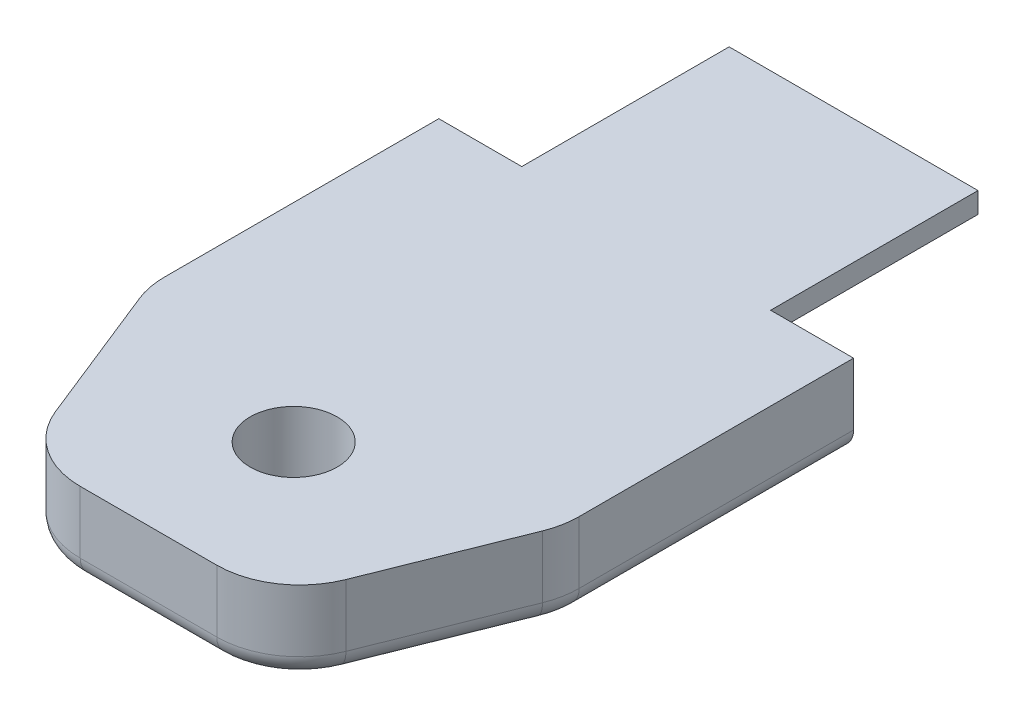
ISO-10303-21;
HEADER;
FILE_DESCRIPTION(('STEP AP214'),'2;1');
FILE_NAME('part.step','',(''),(''),'','','');
FILE_SCHEMA(('AUTOMOTIVE_DESIGN { 1 0 10303 214 1 1 1 1 }'));
ENDSEC;
DATA;
#1=APPLICATION_CONTEXT('core data for automotive mechanical design processes');
#2=APPLICATION_PROTOCOL_DEFINITION('international standard','automotive_design',2000,#1);
#3=PRODUCT_CONTEXT('',#1,'mechanical');
#4=PRODUCT('Part','Part','',(#3));
#5=PRODUCT_RELATED_PRODUCT_CATEGORY('part','',(#4));
#6=PRODUCT_DEFINITION_FORMATION('','',#4);
#7=PRODUCT_DEFINITION_CONTEXT('part definition',#1,'design');
#8=PRODUCT_DEFINITION('design','',#6,#7);
#9=PRODUCT_DEFINITION_SHAPE('','',#8);
#10=(LENGTH_UNIT() NAMED_UNIT(*) SI_UNIT(.MILLI.,.METRE.));
#11=(NAMED_UNIT(*) PLANE_ANGLE_UNIT() SI_UNIT($,.RADIAN.));
#12=(NAMED_UNIT(*) SI_UNIT($,.STERADIAN.) SOLID_ANGLE_UNIT());
#13=UNCERTAINTY_MEASURE_WITH_UNIT(LENGTH_MEASURE(1.E-05),#10,'distance_accuracy_value','');
#14=(GEOMETRIC_REPRESENTATION_CONTEXT(3) GLOBAL_UNCERTAINTY_ASSIGNED_CONTEXT((#13)) GLOBAL_UNIT_ASSIGNED_CONTEXT((#10,
#11,#12)) REPRESENTATION_CONTEXT('',''));
#15=CARTESIAN_POINT('',(0.,0.,0.));
#16=DIRECTION('',(0.,0.,1.));
#17=DIRECTION('',(1.,0.,0.));
#18=AXIS2_PLACEMENT_3D('',#15,#16,#17);
#19=CARTESIAN_POINT('',(-6.00000000000001,3.,10.));
#20=DIRECTION('',(0.707106781186548,0.707106781186547,0.));
#21=DIRECTION('',(-0.707106781186547,0.707106781186548,0.));
#22=AXIS2_PLACEMENT_3D('',#19,#20,#21);
#23=PLANE('',#22);
#24=DIRECTION('',(0.707106781186547,-0.707106781186548,0.));
#25=VECTOR('',#24,1.);
#26=CARTESIAN_POINT('',(-6.00000000000001,3.,0.));
#27=LINE('',#26,#25);
#28=CARTESIAN_POINT('',(-6.00000000000001,3.,0.));
#29=VERTEX_POINT('',#28);
#30=CARTESIAN_POINT('',(-3.00000000000001,0.,0.));
#31=VERTEX_POINT('',#30);
#32=EDGE_CURVE('E203',#29,#31,#27,.T.);
#33=ORIENTED_EDGE('',*,*,#32,.T.);
#34=DIRECTION('',(0.,0.,-1.));
#35=VECTOR('',#34,1.);
#36=CARTESIAN_POINT('',(-3.00000000000001,0.,10.));
#37=LINE('',#36,#35);
#38=CARTESIAN_POINT('',(-3.00000000000001,0.,10.));
#39=VERTEX_POINT('',#38);
#40=EDGE_CURVE('E403',#39,#31,#37,.T.);
#41=ORIENTED_EDGE('',*,*,#40,.F.);
#42=DIRECTION('',(0.707106781186547,-0.707106781186548,0.));
#43=VECTOR('',#42,1.);
#44=CARTESIAN_POINT('',(-6.00000000000001,3.,10.));
#45=LINE('',#44,#43);
#46=CARTESIAN_POINT('',(-6.00000000000001,3.,10.));
#47=VERTEX_POINT('',#46);
#48=EDGE_CURVE('E409',#47,#39,#45,.T.);
#49=ORIENTED_EDGE('',*,*,#48,.F.);
#50=DIRECTION('',(0.,0.,-1.));
#51=VECTOR('',#50,1.);
#52=CARTESIAN_POINT('',(-6.00000000000001,3.,10.));
#53=LINE('',#52,#51);
#54=EDGE_CURVE('E454',#47,#29,#53,.T.);
#55=ORIENTED_EDGE('',*,*,#54,.T.);
#56=EDGE_LOOP('',(#33,#41,#49,#55));
#57=FACE_BOUND('',#56,.T.);
#58=ADVANCED_FACE('F36',(#57),#23,.F.);
#59=CARTESIAN_POINT('',(-3.00000000000001,0.,10.));
#60=DIRECTION('',(0.,1.,0.));
#61=DIRECTION('',(0.,0.,1.));
#62=AXIS2_PLACEMENT_3D('',#59,#60,#61);
#63=PLANE('',#62);
#64=CARTESIAN_POINT('',(0.,0.,27.));
#65=DIRECTION('',(0.,-1.,0.));
#66=DIRECTION('',(0.,0.,-1.));
#67=AXIS2_PLACEMENT_3D('',#64,#65,#66);
#68=CIRCLE('',#67,2.1);
#69=CARTESIAN_POINT('',(0.,0.,24.9));
#70=VERTEX_POINT('',#69);
#71=EDGE_CURVE('E238',#70,#70,#68,.T.);
#72=ORIENTED_EDGE('',*,*,#71,.F.);
#73=EDGE_LOOP('',(#72));
#74=FACE_BOUND('',#73,.T.);
#75=DIRECTION('',(1.,0.,0.));
#76=VECTOR('',#75,1.);
#77=CARTESIAN_POINT('',(-10.,0.,10.));
#78=LINE('',#77,#76);
#79=CARTESIAN_POINT('',(3.,0.,10.));
#80=VERTEX_POINT('',#79);
#81=CARTESIAN_POINT('',(9.,0.,10.));
#82=VERTEX_POINT('',#81);
#83=EDGE_CURVE('E233',#80,#82,#78,.T.);
#84=ORIENTED_EDGE('',*,*,#83,.T.);
#85=DIRECTION('',(0.,0.,-1.));
#86=VECTOR('',#85,1.);
#87=CARTESIAN_POINT('',(9.,0.,10.));
#88=LINE('',#87,#86);
#89=CARTESIAN_POINT('',(9.,0.,23.2296703857309));
#90=VERTEX_POINT('',#89);
#91=EDGE_CURVE('E265',#82,#90,#88,.F.);
#92=ORIENTED_EDGE('',*,*,#91,.T.);
#93=CARTESIAN_POINT('',(6.,0.,23.2296703857309));
#94=DIRECTION('',(0.,1.,0.));
#95=DIRECTION('',(0.,0.,1.));
#96=AXIS2_PLACEMENT_3D('',#93,#94,#95);
#97=CIRCLE('',#96,3.);
#98=CARTESIAN_POINT('',(8.78543007265578,0.,24.3438424147932));
#99=VERTEX_POINT('',#98);
#100=EDGE_CURVE('E263',#90,#99,#97,.F.);
#101=ORIENTED_EDGE('',*,*,#100,.T.);
#102=DIRECTION('',(0.371390676354101,0.,-0.92847669088526));
#103=VECTOR('',#102,1.);
#104=CARTESIAN_POINT('',(6.07729822694816,0.,31.1141720290623));
#105=LINE('',#104,#103);
#106=CARTESIAN_POINT('',(6.07729822694816,0.,31.1141720290623));
#107=VERTEX_POINT('',#106);
#108=EDGE_CURVE('E261',#99,#107,#105,.F.);
#109=ORIENTED_EDGE('',*,*,#108,.T.);
#110=CARTESIAN_POINT('',(3.29186815429238,0.,30.));
#111=DIRECTION('',(0.,1.,0.));
#112=DIRECTION('',(0.,0.,1.));
#113=AXIS2_PLACEMENT_3D('',#110,#111,#112);
#114=CIRCLE('',#113,3.);
#115=CARTESIAN_POINT('',(3.29186815429238,0.,33.));
#116=VERTEX_POINT('',#115);
#117=EDGE_CURVE('E259',#107,#116,#114,.F.);
#118=ORIENTED_EDGE('',*,*,#117,.T.);
#119=DIRECTION('',(1.,0.,0.));
#120=VECTOR('',#119,1.);
#121=CARTESIAN_POINT('',(-3.00000000000001,0.,33.));
#122=LINE('',#121,#120);
#123=CARTESIAN_POINT('',(-3.29186815429238,0.,33.));
#124=VERTEX_POINT('',#123);
#125=EDGE_CURVE('E257',#116,#124,#122,.F.);
#126=ORIENTED_EDGE('',*,*,#125,.T.);
#127=CARTESIAN_POINT('',(-3.29186815429238,0.,30.));
#128=DIRECTION('',(0.,1.,0.));
#129=DIRECTION('',(0.,0.,1.));
#130=AXIS2_PLACEMENT_3D('',#127,#128,#129);
#131=CIRCLE('',#130,3.);
#132=CARTESIAN_POINT('',(-6.07729822694816,0.,31.1141720290623));
#133=VERTEX_POINT('',#132);
#134=EDGE_CURVE('E255',#124,#133,#131,.F.);
#135=ORIENTED_EDGE('',*,*,#134,.T.);
#136=DIRECTION('',(0.371390676354101,0.,0.92847669088526));
#137=VECTOR('',#136,1.);
#138=CARTESIAN_POINT('',(-8.78543007265578,0.,24.3438424147932));
#139=LINE('',#138,#137);
#140=CARTESIAN_POINT('',(-8.78543007265578,0.,24.3438424147932));
#141=VERTEX_POINT('',#140);
#142=EDGE_CURVE('E253',#133,#141,#139,.F.);
#143=ORIENTED_EDGE('',*,*,#142,.T.);
#144=CARTESIAN_POINT('',(-6.,0.,23.2296703857309));
#145=DIRECTION('',(0.,1.,0.));
#146=DIRECTION('',(0.,0.,1.));
#147=AXIS2_PLACEMENT_3D('',#144,#145,#146);
#148=CIRCLE('',#147,3.);
#149=CARTESIAN_POINT('',(-9.,0.,23.2296703857309));
#150=VERTEX_POINT('',#149);
#151=EDGE_CURVE('E251',#141,#150,#148,.F.);
#152=ORIENTED_EDGE('',*,*,#151,.T.);
#153=DIRECTION('',(0.,0.,-1.));
#154=VECTOR('',#153,1.);
#155=CARTESIAN_POINT('',(-9.,0.,10.));
#156=LINE('',#155,#154);
#157=CARTESIAN_POINT('',(-9.,0.,10.));
#158=VERTEX_POINT('',#157);
#159=EDGE_CURVE('E249',#150,#158,#156,.T.);
#160=ORIENTED_EDGE('',*,*,#159,.T.);
#161=EDGE_CURVE('E192',#158,#39,#78,.T.);
#162=ORIENTED_EDGE('',*,*,#161,.T.);
#163=ORIENTED_EDGE('',*,*,#40,.T.);
#164=DIRECTION('',(1.,0.,0.));
#165=VECTOR('',#164,1.);
#166=CARTESIAN_POINT('',(-3.00000000000001,0.,0.));
#167=LINE('',#166,#165);
#168=CARTESIAN_POINT('',(3.,0.,0.));
#169=VERTEX_POINT('',#168);
#170=EDGE_CURVE('E465',#31,#169,#167,.T.);
#171=ORIENTED_EDGE('',*,*,#170,.T.);
#172=DIRECTION('',(0.,0.,-1.));
#173=VECTOR('',#172,1.);
#174=CARTESIAN_POINT('',(3.,0.,10.));
#175=LINE('',#174,#173);
#176=EDGE_CURVE('E325',#80,#169,#175,.T.);
#177=ORIENTED_EDGE('',*,*,#176,.F.);
#178=EDGE_LOOP('',(#84,#92,#101,#109,#118,#126,#135,#143,#152,#160,#162,#163,#171,#177));
#179=FACE_BOUND('',#178,.T.);
#180=ADVANCED_FACE('F316',(#74,#179),#63,.F.);
#181=CARTESIAN_POINT('',(3.,0.,10.));
#182=DIRECTION('',(-0.707106781186548,0.707106781186547,0.));
#183=DIRECTION('',(-0.707106781186547,-0.707106781186548,0.));
#184=AXIS2_PLACEMENT_3D('',#181,#182,#183);
#185=PLANE('',#184);
#186=DIRECTION('',(0.707106781186547,0.707106781186548,0.));
#187=VECTOR('',#186,1.);
#188=CARTESIAN_POINT('',(3.,0.,0.));
#189=LINE('',#188,#187);
#190=CARTESIAN_POINT('',(6.,3.,0.));
#191=VERTEX_POINT('',#190);
#192=EDGE_CURVE('E437',#169,#191,#189,.T.);
#193=ORIENTED_EDGE('',*,*,#192,.T.);
#194=DIRECTION('',(0.,0.,-1.));
#195=VECTOR('',#194,1.);
#196=CARTESIAN_POINT('',(6.,3.,10.));
#197=LINE('',#196,#195);
#198=CARTESIAN_POINT('',(6.,3.,10.));
#199=VERTEX_POINT('',#198);
#200=EDGE_CURVE('E429',#199,#191,#197,.T.);
#201=ORIENTED_EDGE('',*,*,#200,.F.);
#202=DIRECTION('',(0.707106781186547,0.707106781186548,0.));
#203=VECTOR('',#202,1.);
#204=CARTESIAN_POINT('',(3.,0.,10.));
#205=LINE('',#204,#203);
#206=EDGE_CURVE('E412',#80,#199,#205,.T.);
#207=ORIENTED_EDGE('',*,*,#206,.F.);
#208=ORIENTED_EDGE('',*,*,#176,.T.);
#209=EDGE_LOOP('',(#193,#201,#207,#208));
#210=FACE_BOUND('',#209,.T.);
#211=ADVANCED_FACE('F319',(#210),#185,.F.);
#212=CARTESIAN_POINT('',(6.,3.,10.));
#213=DIRECTION('',(-1.,0.,0.));
#214=DIRECTION('',(0.,-1.,0.));
#215=AXIS2_PLACEMENT_3D('',#212,#213,#214);
#216=PLANE('',#215);
#217=DIRECTION('',(0.,1.,0.));
#218=VECTOR('',#217,1.);
#219=CARTESIAN_POINT('',(6.,3.,0.));
#220=LINE('',#219,#218);
#221=CARTESIAN_POINT('',(6.,4.,0.));
#222=VERTEX_POINT('',#221);
#223=EDGE_CURVE('E442',#191,#222,#220,.T.);
#224=ORIENTED_EDGE('',*,*,#223,.T.);
#225=DIRECTION('',(0.,0.,-1.));
#226=VECTOR('',#225,1.);
#227=CARTESIAN_POINT('',(6.,4.,10.));
#228=LINE('',#227,#226);
#229=CARTESIAN_POINT('',(6.,4.,10.));
#230=VERTEX_POINT('',#229);
#231=EDGE_CURVE('E427',#230,#222,#228,.T.);
#232=ORIENTED_EDGE('',*,*,#231,.F.);
#233=DIRECTION('',(0.,1.,0.));
#234=VECTOR('',#233,1.);
#235=CARTESIAN_POINT('',(6.,3.,10.));
#236=LINE('',#235,#234);
#237=EDGE_CURVE('E210',#199,#230,#236,.T.);
#238=ORIENTED_EDGE('',*,*,#237,.F.);
#239=ORIENTED_EDGE('',*,*,#200,.T.);
#240=EDGE_LOOP('',(#224,#232,#238,#239));
#241=FACE_BOUND('',#240,.T.);
#242=ADVANCED_FACE('F441',(#241),#216,.F.);
#243=CARTESIAN_POINT('',(6.,4.,10.));
#244=DIRECTION('',(0.,-1.,0.));
#245=DIRECTION('',(1.,0.,0.));
#246=AXIS2_PLACEMENT_3D('',#243,#244,#245);
#247=PLANE('',#246);
#248=CARTESIAN_POINT('',(0.,4.,27.));
#249=DIRECTION('',(0.,-1.,0.));
#250=DIRECTION('',(1.,0.,0.));
#251=AXIS2_PLACEMENT_3D('',#248,#249,#250);
#252=CIRCLE('',#251,2.1);
#253=CARTESIAN_POINT('',(2.1,4.,27.));
#254=VERTEX_POINT('',#253);
#255=EDGE_CURVE('E234',#254,#254,#252,.T.);
#256=ORIENTED_EDGE('',*,*,#255,.T.);
#257=EDGE_LOOP('',(#256));
#258=FACE_BOUND('',#257,.T.);
#259=DIRECTION('',(0.,0.,-1.));
#260=VECTOR('',#259,1.);
#261=CARTESIAN_POINT('',(-10.,4.,34.));
#262=LINE('',#261,#260);
#263=CARTESIAN_POINT('',(-10.,4.,23.2296703857309));
#264=VERTEX_POINT('',#263);
#265=CARTESIAN_POINT('',(-10.,4.,10.));
#266=VERTEX_POINT('',#265);
#267=EDGE_CURVE('E204',#264,#266,#262,.T.);
#268=ORIENTED_EDGE('',*,*,#267,.F.);
#269=CARTESIAN_POINT('',(-6.,4.,23.2296703857309));
#270=DIRECTION('',(0.,-1.,0.));
#271=DIRECTION('',(1.,0.,0.));
#272=AXIS2_PLACEMENT_3D('',#269,#270,#271);
#273=CIRCLE('',#272,4.);
#274=CARTESIAN_POINT('',(-9.71390676354104,4.,24.7152330911473));
#275=VERTEX_POINT('',#274);
#276=EDGE_CURVE('E370',#264,#275,#273,.F.);
#277=ORIENTED_EDGE('',*,*,#276,.T.);
#278=DIRECTION('',(-0.371390676354101,0.,-0.92847669088526));
#279=VECTOR('',#278,1.);
#280=CARTESIAN_POINT('',(-5.99999999999999,4.,34.));
#281=LINE('',#280,#279);
#282=CARTESIAN_POINT('',(-7.00577491783343,4.,31.4855627054164));
#283=VERTEX_POINT('',#282);
#284=EDGE_CURVE('E396',#275,#283,#281,.F.);
#285=ORIENTED_EDGE('',*,*,#284,.T.);
#286=CARTESIAN_POINT('',(-3.29186815429238,4.,30.));
#287=DIRECTION('',(0.,-1.,0.));
#288=DIRECTION('',(1.,0.,0.));
#289=AXIS2_PLACEMENT_3D('',#286,#287,#288);
#290=CIRCLE('',#289,4.);
#291=CARTESIAN_POINT('',(-3.29186815429238,4.,34.));
#292=VERTEX_POINT('',#291);
#293=EDGE_CURVE('E369',#283,#292,#290,.F.);
#294=ORIENTED_EDGE('',*,*,#293,.T.);
#295=DIRECTION('',(-1.,0.,0.));
#296=VECTOR('',#295,1.);
#297=CARTESIAN_POINT('',(-10.,4.,34.));
#298=LINE('',#297,#296);
#299=CARTESIAN_POINT('',(3.29186815429238,4.,34.));
#300=VERTEX_POINT('',#299);
#301=EDGE_CURVE('E211',#300,#292,#298,.T.);
#302=ORIENTED_EDGE('',*,*,#301,.F.);
#303=CARTESIAN_POINT('',(3.29186815429238,4.,30.));
#304=DIRECTION('',(0.,-1.,0.));
#305=DIRECTION('',(1.,0.,0.));
#306=AXIS2_PLACEMENT_3D('',#303,#304,#305);
#307=CIRCLE('',#306,4.);
#308=CARTESIAN_POINT('',(7.00577491783343,4.,31.4855627054164));
#309=VERTEX_POINT('',#308);
#310=EDGE_CURVE('E395',#300,#309,#307,.F.);
#311=ORIENTED_EDGE('',*,*,#310,.T.);
#312=DIRECTION('',(-0.371390676354101,0.,0.92847669088526));
#313=VECTOR('',#312,1.);
#314=CARTESIAN_POINT('',(5.99999999999999,4.,34.));
#315=LINE('',#314,#313);
#316=CARTESIAN_POINT('',(9.71390676354104,4.,24.7152330911473));
#317=VERTEX_POINT('',#316);
#318=EDGE_CURVE('E390',#309,#317,#315,.F.);
#319=ORIENTED_EDGE('',*,*,#318,.T.);
#320=CARTESIAN_POINT('',(6.,4.,23.2296703857309));
#321=DIRECTION('',(0.,-1.,0.));
#322=DIRECTION('',(1.,0.,0.));
#323=AXIS2_PLACEMENT_3D('',#320,#321,#322);
#324=CIRCLE('',#323,4.);
#325=CARTESIAN_POINT('',(10.,4.,23.2296703857309));
#326=VERTEX_POINT('',#325);
#327=EDGE_CURVE('E202',#317,#326,#324,.F.);
#328=ORIENTED_EDGE('',*,*,#327,.T.);
#329=DIRECTION('',(0.,0.,-1.));
#330=VECTOR('',#329,1.);
#331=CARTESIAN_POINT('',(10.,4.,34.));
#332=LINE('',#331,#330);
#333=CARTESIAN_POINT('',(10.,4.,10.));
#334=VERTEX_POINT('',#333);
#335=EDGE_CURVE('E185',#326,#334,#332,.T.);
#336=ORIENTED_EDGE('',*,*,#335,.T.);
#337=DIRECTION('',(-1.,0.,0.));
#338=VECTOR('',#337,1.);
#339=CARTESIAN_POINT('',(-10.,4.,10.));
#340=LINE('',#339,#338);
#341=EDGE_CURVE('E199',#334,#230,#340,.T.);
#342=ORIENTED_EDGE('',*,*,#341,.T.);
#343=ORIENTED_EDGE('',*,*,#231,.T.);
#344=DIRECTION('',(-1.,0.,0.));
#345=VECTOR('',#344,1.);
#346=CARTESIAN_POINT('',(6.,4.,0.));
#347=LINE('',#346,#345);
#348=CARTESIAN_POINT('',(-6.,4.,0.));
#349=VERTEX_POINT('',#348);
#350=EDGE_CURVE('E444',#222,#349,#347,.T.);
#351=ORIENTED_EDGE('',*,*,#350,.T.);
#352=DIRECTION('',(0.,0.,-1.));
#353=VECTOR('',#352,1.);
#354=CARTESIAN_POINT('',(-6.,4.,10.));
#355=LINE('',#354,#353);
#356=CARTESIAN_POINT('',(-6.,4.,10.));
#357=VERTEX_POINT('',#356);
#358=EDGE_CURVE('E229',#357,#349,#355,.T.);
#359=ORIENTED_EDGE('',*,*,#358,.F.);
#360=EDGE_CURVE('E191',#357,#266,#340,.T.);
#361=ORIENTED_EDGE('',*,*,#360,.T.);
#362=EDGE_LOOP('',(#268,#277,#285,#294,#302,#311,#319,#328,#336,#342,#343,#351,#359,#361));
#363=FACE_BOUND('',#362,.T.);
#364=ADVANCED_FACE('F197',(#258,#363),#247,.F.);
#365=CARTESIAN_POINT('',(-6.,4.,10.));
#366=DIRECTION('',(1.,0.,0.));
#367=DIRECTION('',(0.,1.,0.));
#368=AXIS2_PLACEMENT_3D('',#365,#366,#367);
#369=PLANE('',#368);
#370=DIRECTION('',(0.,-1.,0.));
#371=VECTOR('',#370,1.);
#372=CARTESIAN_POINT('',(-6.,4.,0.));
#373=LINE('',#372,#371);
#374=EDGE_CURVE('E413',#349,#29,#373,.T.);
#375=ORIENTED_EDGE('',*,*,#374,.T.);
#376=ORIENTED_EDGE('',*,*,#54,.F.);
#377=DIRECTION('',(0.,-1.,0.));
#378=VECTOR('',#377,1.);
#379=CARTESIAN_POINT('',(-6.,4.,10.));
#380=LINE('',#379,#378);
#381=EDGE_CURVE('E424',#357,#47,#380,.T.);
#382=ORIENTED_EDGE('',*,*,#381,.F.);
#383=ORIENTED_EDGE('',*,*,#358,.T.);
#384=EDGE_LOOP('',(#375,#376,#382,#383));
#385=FACE_BOUND('',#384,.T.);
#386=ADVANCED_FACE('F461',(#385),#369,.F.);
#387=CARTESIAN_POINT('',(0.,0.,0.));
#388=DIRECTION('',(0.,0.,1.));
#389=DIRECTION('',(1.,0.,0.));
#390=AXIS2_PLACEMENT_3D('',#387,#388,#389);
#391=PLANE('',#390);
#392=ORIENTED_EDGE('',*,*,#32,.F.);
#393=ORIENTED_EDGE('',*,*,#374,.F.);
#394=ORIENTED_EDGE('',*,*,#350,.F.);
#395=ORIENTED_EDGE('',*,*,#223,.F.);
#396=ORIENTED_EDGE('',*,*,#192,.F.);
#397=ORIENTED_EDGE('',*,*,#170,.F.);
#398=EDGE_LOOP('',(#392,#393,#394,#395,#396,#397));
#399=FACE_BOUND('',#398,.T.);
#400=ADVANCED_FACE('F448',(#399),#391,.F.);
#401=CARTESIAN_POINT('',(0.,0.,10.));
#402=DIRECTION('',(0.,0.,-1.));
#403=DIRECTION('',(-1.,0.,0.));
#404=AXIS2_PLACEMENT_3D('',#401,#402,#403);
#405=PLANE('',#404);
#406=DIRECTION('',(0.,1.,0.));
#407=VECTOR('',#406,1.);
#408=CARTESIAN_POINT('',(10.,0.,10.));
#409=LINE('',#408,#407);
#410=CARTESIAN_POINT('',(10.,1.,10.));
#411=VERTEX_POINT('',#410);
#412=EDGE_CURVE('E181',#411,#334,#409,.T.);
#413=ORIENTED_EDGE('',*,*,#412,.F.);
#414=CARTESIAN_POINT('',(9.,1.,10.));
#415=DIRECTION('',(0.,0.,-1.));
#416=DIRECTION('',(-1.,0.,0.));
#417=AXIS2_PLACEMENT_3D('',#414,#415,#416);
#418=CIRCLE('',#417,1.);
#419=EDGE_CURVE('E247',#411,#82,#418,.T.);
#420=ORIENTED_EDGE('',*,*,#419,.T.);
#421=ORIENTED_EDGE('',*,*,#83,.F.);
#422=ORIENTED_EDGE('',*,*,#206,.T.);
#423=ORIENTED_EDGE('',*,*,#237,.T.);
#424=ORIENTED_EDGE('',*,*,#341,.F.);
#425=EDGE_LOOP('',(#413,#420,#421,#422,#423,#424));
#426=FACE_BOUND('',#425,.T.);
#427=ADVANCED_FACE('F207',(#426),#405,.T.);
#428=CARTESIAN_POINT('',(-10.,0.,34.));
#429=DIRECTION('',(1.,0.,0.));
#430=DIRECTION('',(0.,0.,-1.));
#431=AXIS2_PLACEMENT_3D('',#428,#429,#430);
#432=PLANE('',#431);
#433=DIRECTION('',(0.,-1.,0.));
#434=VECTOR('',#433,1.);
#435=CARTESIAN_POINT('',(-10.,0.,10.));
#436=LINE('',#435,#434);
#437=CARTESIAN_POINT('',(-10.,1.,10.));
#438=VERTEX_POINT('',#437);
#439=EDGE_CURVE('E224',#266,#438,#436,.T.);
#440=ORIENTED_EDGE('',*,*,#439,.T.);
#441=DIRECTION('',(0.,0.,-1.));
#442=VECTOR('',#441,1.);
#443=CARTESIAN_POINT('',(-10.,1.,34.));
#444=LINE('',#443,#442);
#445=CARTESIAN_POINT('',(-10.,1.,23.2296703857309));
#446=VERTEX_POINT('',#445);
#447=EDGE_CURVE('E11',#438,#446,#444,.F.);
#448=ORIENTED_EDGE('',*,*,#447,.T.);
#449=DIRECTION('',(0.,-1.,0.));
#450=VECTOR('',#449,1.);
#451=CARTESIAN_POINT('',(-10.,4.,23.2296703857309));
#452=LINE('',#451,#450);
#453=EDGE_CURVE('E225',#446,#264,#452,.F.);
#454=ORIENTED_EDGE('',*,*,#453,.T.);
#455=ORIENTED_EDGE('',*,*,#267,.T.);
#456=EDGE_LOOP('',(#440,#448,#454,#455));
#457=FACE_BOUND('',#456,.T.);
#458=ADVANCED_FACE('F223',(#457),#432,.F.);
#459=CARTESIAN_POINT('',(10.,0.,34.));
#460=DIRECTION('',(-1.,0.,0.));
#461=DIRECTION('',(0.,0.,1.));
#462=AXIS2_PLACEMENT_3D('',#459,#460,#461);
#463=PLANE('',#462);
#464=DIRECTION('',(0.,1.,0.));
#465=VECTOR('',#464,1.);
#466=CARTESIAN_POINT('',(10.,0.,23.2296703857309));
#467=LINE('',#466,#465);
#468=CARTESIAN_POINT('',(10.,1.,23.2296703857309));
#469=VERTEX_POINT('',#468);
#470=EDGE_CURVE('E380',#326,#469,#467,.F.);
#471=ORIENTED_EDGE('',*,*,#470,.T.);
#472=DIRECTION('',(0.,0.,-1.));
#473=VECTOR('',#472,1.);
#474=CARTESIAN_POINT('',(10.,1.,34.));
#475=LINE('',#474,#473);
#476=EDGE_CURVE('E188',#469,#411,#475,.T.);
#477=ORIENTED_EDGE('',*,*,#476,.T.);
#478=ORIENTED_EDGE('',*,*,#412,.T.);
#479=ORIENTED_EDGE('',*,*,#335,.F.);
#480=EDGE_LOOP('',(#471,#477,#478,#479));
#481=FACE_BOUND('',#480,.T.);
#482=ADVANCED_FACE('F184',(#481),#463,.F.);
#483=CARTESIAN_POINT('',(0.,0.,34.));
#484=DIRECTION('',(0.,0.,-1.));
#485=DIRECTION('',(-1.,0.,0.));
#486=AXIS2_PLACEMENT_3D('',#483,#484,#485);
#487=PLANE('',#486);
#488=DIRECTION('',(0.,1.,0.));
#489=VECTOR('',#488,1.);
#490=CARTESIAN_POINT('',(-3.29186815429238,0.,34.));
#491=LINE('',#490,#489);
#492=CARTESIAN_POINT('',(-3.29186815429238,1.,34.));
#493=VERTEX_POINT('',#492);
#494=EDGE_CURVE('E378',#292,#493,#491,.F.);
#495=ORIENTED_EDGE('',*,*,#494,.T.);
#496=DIRECTION('',(1.,0.,0.));
#497=VECTOR('',#496,1.);
#498=CARTESIAN_POINT('',(0.,1.,34.));
#499=LINE('',#498,#497);
#500=CARTESIAN_POINT('',(3.29186815429238,1.,34.));
#501=VERTEX_POINT('',#500);
#502=EDGE_CURVE('E273',#493,#501,#499,.T.);
#503=ORIENTED_EDGE('',*,*,#502,.T.);
#504=DIRECTION('',(0.,-1.,0.));
#505=VECTOR('',#504,1.);
#506=CARTESIAN_POINT('',(3.29186815429238,4.,34.));
#507=LINE('',#506,#505);
#508=EDGE_CURVE('E372',#501,#300,#507,.F.);
#509=ORIENTED_EDGE('',*,*,#508,.T.);
#510=ORIENTED_EDGE('',*,*,#301,.T.);
#511=EDGE_LOOP('',(#495,#503,#509,#510));
#512=FACE_BOUND('',#511,.T.);
#513=ADVANCED_FACE('F472',(#512),#487,.F.);
#514=ORIENTED_EDGE('',*,*,#161,.F.);
#515=CARTESIAN_POINT('',(-9.,1.,10.));
#516=DIRECTION('',(0.,0.,-1.));
#517=DIRECTION('',(-1.,0.,0.));
#518=AXIS2_PLACEMENT_3D('',#515,#516,#517);
#519=CIRCLE('',#518,1.);
#520=EDGE_CURVE('E45',#158,#438,#519,.T.);
#521=ORIENTED_EDGE('',*,*,#520,.T.);
#522=ORIENTED_EDGE('',*,*,#439,.F.);
#523=ORIENTED_EDGE('',*,*,#360,.F.);
#524=ORIENTED_EDGE('',*,*,#381,.T.);
#525=ORIENTED_EDGE('',*,*,#48,.T.);
#526=EDGE_LOOP('',(#514,#521,#522,#523,#524,#525));
#527=FACE_BOUND('',#526,.T.);
#528=ADVANCED_FACE('F232',(#527),#405,.T.);
#529=CARTESIAN_POINT('',(0.,4.00005,27.));
#530=DIRECTION('',(0.,-1.,0.));
#531=DIRECTION('',(0.,0.,-1.));
#532=AXIS2_PLACEMENT_3D('',#529,#530,#531);
#533=CYLINDRICAL_SURFACE('',#532,2.1);
#534=ORIENTED_EDGE('',*,*,#71,.T.);
#535=EDGE_LOOP('',(#534));
#536=FACE_BOUND('',#535,.T.);
#537=ORIENTED_EDGE('',*,*,#255,.F.);
#538=EDGE_LOOP('',(#537));
#539=FACE_BOUND('',#538,.T.);
#540=ADVANCED_FACE('F313',(#536,#539),#533,.F.);
#541=CARTESIAN_POINT('',(5.99999999999999,0.,34.));
#542=DIRECTION('',(-0.92847669088526,0.,-0.371390676354101));
#543=DIRECTION('',(0.,1.,0.));
#544=AXIS2_PLACEMENT_3D('',#541,#542,#543);
#545=PLANE('',#544);
#546=DIRECTION('',(0.,1.,0.));
#547=VECTOR('',#546,1.);
#548=CARTESIAN_POINT('',(7.00577491783343,0.,31.4855627054164));
#549=LINE('',#548,#547);
#550=CARTESIAN_POINT('',(7.00577491783343,1.,31.4855627054164));
#551=VERTEX_POINT('',#550);
#552=EDGE_CURVE('E382',#309,#551,#549,.F.);
#553=ORIENTED_EDGE('',*,*,#552,.T.);
#554=DIRECTION('',(-0.371390676354101,0.,0.92847669088526));
#555=VECTOR('',#554,1.);
#556=CARTESIAN_POINT('',(9.71390676354104,1.,24.7152330911473));
#557=LINE('',#556,#555);
#558=CARTESIAN_POINT('',(9.71390676354104,1.,24.7152330911473));
#559=VERTEX_POINT('',#558);
#560=EDGE_CURVE('E269',#551,#559,#557,.F.);
#561=ORIENTED_EDGE('',*,*,#560,.T.);
#562=DIRECTION('',(0.,-1.,0.));
#563=VECTOR('',#562,1.);
#564=CARTESIAN_POINT('',(9.71390676354104,4.,24.7152330911473));
#565=LINE('',#564,#563);
#566=EDGE_CURVE('E385',#559,#317,#565,.F.);
#567=ORIENTED_EDGE('',*,*,#566,.T.);
#568=ORIENTED_EDGE('',*,*,#318,.F.);
#569=EDGE_LOOP('',(#553,#561,#567,#568));
#570=FACE_BOUND('',#569,.T.);
#571=ADVANCED_FACE('F389',(#570),#545,.F.);
#572=CARTESIAN_POINT('',(-5.99999999999999,0.,34.));
#573=DIRECTION('',(0.92847669088526,0.,-0.371390676354101));
#574=DIRECTION('',(0.,-1.,0.));
#575=AXIS2_PLACEMENT_3D('',#572,#573,#574);
#576=PLANE('',#575);
#577=DIRECTION('',(0.,1.,0.));
#578=VECTOR('',#577,1.);
#579=CARTESIAN_POINT('',(-9.71390676354104,0.,24.7152330911473));
#580=LINE('',#579,#578);
#581=CARTESIAN_POINT('',(-9.71390676354104,1.,24.7152330911473));
#582=VERTEX_POINT('',#581);
#583=EDGE_CURVE('E363',#275,#582,#580,.F.);
#584=ORIENTED_EDGE('',*,*,#583,.T.);
#585=DIRECTION('',(-0.371390676354101,0.,-0.92847669088526));
#586=VECTOR('',#585,1.);
#587=CARTESIAN_POINT('',(-7.00577491783343,1.,31.4855627054164));
#588=LINE('',#587,#586);
#589=CARTESIAN_POINT('',(-7.00577491783343,1.,31.4855627054164));
#590=VERTEX_POINT('',#589);
#591=EDGE_CURVE('E277',#582,#590,#588,.F.);
#592=ORIENTED_EDGE('',*,*,#591,.T.);
#593=DIRECTION('',(0.,-1.,0.));
#594=VECTOR('',#593,1.);
#595=CARTESIAN_POINT('',(-7.00577491783343,4.,31.4855627054164));
#596=LINE('',#595,#594);
#597=EDGE_CURVE('E360',#590,#283,#596,.F.);
#598=ORIENTED_EDGE('',*,*,#597,.T.);
#599=ORIENTED_EDGE('',*,*,#284,.F.);
#600=EDGE_LOOP('',(#584,#592,#598,#599));
#601=FACE_BOUND('',#600,.T.);
#602=ADVANCED_FACE('F358',(#601),#576,.F.);
#603=CARTESIAN_POINT('',(-6.,0.,23.2296703857309));
#604=DIRECTION('',(0.,1.,0.));
#605=DIRECTION('',(0.,0.,1.));
#606=AXIS2_PLACEMENT_3D('',#603,#604,#605);
#607=CYLINDRICAL_SURFACE('',#606,4.);
#608=ORIENTED_EDGE('',*,*,#453,.F.);
#609=CARTESIAN_POINT('',(-6.,1.,23.2296703857309));
#610=DIRECTION('',(0.,1.,0.));
#611=DIRECTION('',(0.,0.,1.));
#612=AXIS2_PLACEMENT_3D('',#609,#610,#611);
#613=CIRCLE('',#612,4.);
#614=EDGE_CURVE('E279',#446,#582,#613,.T.);
#615=ORIENTED_EDGE('',*,*,#614,.T.);
#616=ORIENTED_EDGE('',*,*,#583,.F.);
#617=ORIENTED_EDGE('',*,*,#276,.F.);
#618=EDGE_LOOP('',(#608,#615,#616,#617));
#619=FACE_BOUND('',#618,.T.);
#620=ADVANCED_FACE('F470',(#619),#607,.T.);
#621=CARTESIAN_POINT('',(-3.29186815429238,0.,30.));
#622=DIRECTION('',(0.,-1.,0.));
#623=DIRECTION('',(0.,0.,-1.));
#624=AXIS2_PLACEMENT_3D('',#621,#622,#623);
#625=CYLINDRICAL_SURFACE('',#624,4.);
#626=ORIENTED_EDGE('',*,*,#597,.F.);
#627=CARTESIAN_POINT('',(-3.29186815429238,1.,30.));
#628=DIRECTION('',(0.,1.,0.));
#629=DIRECTION('',(0.,0.,1.));
#630=AXIS2_PLACEMENT_3D('',#627,#628,#629);
#631=CIRCLE('',#630,4.);
#632=EDGE_CURVE('E275',#590,#493,#631,.T.);
#633=ORIENTED_EDGE('',*,*,#632,.T.);
#634=ORIENTED_EDGE('',*,*,#494,.F.);
#635=ORIENTED_EDGE('',*,*,#293,.F.);
#636=EDGE_LOOP('',(#626,#633,#634,#635));
#637=FACE_BOUND('',#636,.T.);
#638=ADVANCED_FACE('F366',(#637),#625,.T.);
#639=CARTESIAN_POINT('',(6.,0.,23.2296703857309));
#640=DIRECTION('',(0.,-1.,0.));
#641=DIRECTION('',(0.,0.,-1.));
#642=AXIS2_PLACEMENT_3D('',#639,#640,#641);
#643=CYLINDRICAL_SURFACE('',#642,4.);
#644=ORIENTED_EDGE('',*,*,#566,.F.);
#645=CARTESIAN_POINT('',(6.,1.,23.2296703857309));
#646=DIRECTION('',(0.,1.,0.));
#647=DIRECTION('',(0.,0.,1.));
#648=AXIS2_PLACEMENT_3D('',#645,#646,#647);
#649=CIRCLE('',#648,4.);
#650=EDGE_CURVE('E267',#559,#469,#649,.T.);
#651=ORIENTED_EDGE('',*,*,#650,.T.);
#652=ORIENTED_EDGE('',*,*,#470,.F.);
#653=ORIENTED_EDGE('',*,*,#327,.F.);
#654=EDGE_LOOP('',(#644,#651,#652,#653));
#655=FACE_BOUND('',#654,.T.);
#656=ADVANCED_FACE('F398',(#655),#643,.T.);
#657=CARTESIAN_POINT('',(3.29186815429238,0.,30.));
#658=DIRECTION('',(0.,1.,0.));
#659=DIRECTION('',(0.,0.,1.));
#660=AXIS2_PLACEMENT_3D('',#657,#658,#659);
#661=CYLINDRICAL_SURFACE('',#660,4.);
#662=ORIENTED_EDGE('',*,*,#508,.F.);
#663=CARTESIAN_POINT('',(3.29186815429238,1.,30.));
#664=DIRECTION('',(0.,1.,0.));
#665=DIRECTION('',(0.,0.,1.));
#666=AXIS2_PLACEMENT_3D('',#663,#664,#665);
#667=CIRCLE('',#666,4.);
#668=EDGE_CURVE('E271',#501,#551,#667,.T.);
#669=ORIENTED_EDGE('',*,*,#668,.T.);
#670=ORIENTED_EDGE('',*,*,#552,.F.);
#671=ORIENTED_EDGE('',*,*,#310,.F.);
#672=EDGE_LOOP('',(#662,#669,#670,#671));
#673=FACE_BOUND('',#672,.T.);
#674=ADVANCED_FACE('F475',(#673),#661,.T.);
#675=CARTESIAN_POINT('',(-9.,1.,10.));
#676=DIRECTION('',(0.,0.,-1.));
#677=DIRECTION('',(-1.,0.,0.));
#678=AXIS2_PLACEMENT_3D('',#675,#676,#677);
#679=CYLINDRICAL_SURFACE('',#678,1.);
#680=ORIENTED_EDGE('',*,*,#520,.F.);
#681=ORIENTED_EDGE('',*,*,#159,.F.);
#682=CARTESIAN_POINT('',(-9.,1.,23.2296703857309));
#683=DIRECTION('',(0.,0.,1.));
#684=DIRECTION('',(1.,0.,0.));
#685=AXIS2_PLACEMENT_3D('',#682,#683,#684);
#686=CIRCLE('',#685,1.);
#687=EDGE_CURVE('E40',#446,#150,#686,.T.);
#688=ORIENTED_EDGE('',*,*,#687,.F.);
#689=ORIENTED_EDGE('',*,*,#447,.F.);
#690=EDGE_LOOP('',(#680,#681,#688,#689));
#691=FACE_BOUND('',#690,.T.);
#692=ADVANCED_FACE('F38',(#691),#679,.T.);
#693=CARTESIAN_POINT('',(-6.,1.,23.2296703857309));
#694=DIRECTION('',(0.,1.,0.));
#695=DIRECTION('',(0.,0.,1.));
#696=AXIS2_PLACEMENT_3D('',#693,#694,#695);
#697=TOROIDAL_SURFACE('',#696,3.,1.);
#698=ORIENTED_EDGE('',*,*,#687,.T.);
#699=ORIENTED_EDGE('',*,*,#151,.F.);
#700=CARTESIAN_POINT('',(-8.78543007265578,1.,24.3438424147932));
#701=DIRECTION('',(0.371390676354101,0.,0.928476690885261));
#702=DIRECTION('',(0.928476690885261,0.,-0.371390676354101));
#703=AXIS2_PLACEMENT_3D('',#700,#701,#702);
#704=CIRCLE('',#703,1.);
#705=EDGE_CURVE('E299',#582,#141,#704,.T.);
#706=ORIENTED_EDGE('',*,*,#705,.F.);
#707=ORIENTED_EDGE('',*,*,#614,.F.);
#708=EDGE_LOOP('',(#698,#699,#706,#707));
#709=FACE_BOUND('',#708,.T.);
#710=ADVANCED_FACE('F468',(#709),#697,.T.);
#711=CARTESIAN_POINT('',(-12.9335922746319,1.,13.9734369098527));
#712=DIRECTION('',(-0.371390676354101,0.,-0.92847669088526));
#713=DIRECTION('',(-0.92847669088526,0.,0.371390676354101));
#714=AXIS2_PLACEMENT_3D('',#711,#712,#713);
#715=CYLINDRICAL_SURFACE('',#714,1.);
#716=ORIENTED_EDGE('',*,*,#705,.T.);
#717=ORIENTED_EDGE('',*,*,#142,.F.);
#718=CARTESIAN_POINT('',(-6.07729822694817,1.,31.1141720290623));
#719=DIRECTION('',(0.3713906763541,0.,0.928476690885261));
#720=DIRECTION('',(0.928476690885261,0.,-0.3713906763541));
#721=AXIS2_PLACEMENT_3D('',#718,#719,#720);
#722=CIRCLE('',#721,1.);
#723=EDGE_CURVE('E297',#590,#133,#722,.T.);
#724=ORIENTED_EDGE('',*,*,#723,.F.);
#725=ORIENTED_EDGE('',*,*,#591,.F.);
#726=EDGE_LOOP('',(#716,#717,#724,#725));
#727=FACE_BOUND('',#726,.T.);
#728=ADVANCED_FACE('F354',(#727),#715,.T.);
#729=CARTESIAN_POINT('',(-3.29186815429238,1.,30.));
#730=DIRECTION('',(0.,1.,0.));
#731=DIRECTION('',(0.,0.,1.));
#732=AXIS2_PLACEMENT_3D('',#729,#730,#731);
#733=TOROIDAL_SURFACE('',#732,3.,1.);
#734=ORIENTED_EDGE('',*,*,#723,.T.);
#735=ORIENTED_EDGE('',*,*,#134,.F.);
#736=CARTESIAN_POINT('',(-3.29186815429238,1.,33.));
#737=DIRECTION('',(1.,0.,0.));
#738=DIRECTION('',(0.,0.,-1.));
#739=AXIS2_PLACEMENT_3D('',#736,#737,#738);
#740=CIRCLE('',#739,1.);
#741=EDGE_CURVE('E294',#493,#124,#740,.T.);
#742=ORIENTED_EDGE('',*,*,#741,.F.);
#743=ORIENTED_EDGE('',*,*,#632,.F.);
#744=EDGE_LOOP('',(#734,#735,#742,#743));
#745=FACE_BOUND('',#744,.T.);
#746=ADVANCED_FACE('F352',(#745),#733,.T.);
#747=CARTESIAN_POINT('',(0.,1.,33.));
#748=DIRECTION('',(1.,0.,0.));
#749=DIRECTION('',(0.,0.,-1.));
#750=AXIS2_PLACEMENT_3D('',#747,#748,#749);
#751=CYLINDRICAL_SURFACE('',#750,1.);
#752=ORIENTED_EDGE('',*,*,#741,.T.);
#753=ORIENTED_EDGE('',*,*,#125,.F.);
#754=CARTESIAN_POINT('',(3.29186815429238,1.,33.));
#755=DIRECTION('',(1.,0.,0.));
#756=DIRECTION('',(0.,0.,-1.));
#757=AXIS2_PLACEMENT_3D('',#754,#755,#756);
#758=CIRCLE('',#757,1.);
#759=EDGE_CURVE('E291',#501,#116,#758,.T.);
#760=ORIENTED_EDGE('',*,*,#759,.F.);
#761=ORIENTED_EDGE('',*,*,#502,.F.);
#762=EDGE_LOOP('',(#752,#753,#760,#761));
#763=FACE_BOUND('',#762,.T.);
#764=ADVANCED_FACE('F347',(#763),#751,.T.);
#765=CARTESIAN_POINT('',(3.29186815429238,1.,30.));
#766=DIRECTION('',(0.,1.,0.));
#767=DIRECTION('',(0.,0.,1.));
#768=AXIS2_PLACEMENT_3D('',#765,#766,#767);
#769=TOROIDAL_SURFACE('',#768,3.,1.);
#770=ORIENTED_EDGE('',*,*,#759,.T.);
#771=ORIENTED_EDGE('',*,*,#117,.F.);
#772=CARTESIAN_POINT('',(6.07729822694817,1.,31.1141720290623));
#773=DIRECTION('',(0.3713906763541,0.,-0.928476690885261));
#774=DIRECTION('',(-0.928476690885261,0.,-0.3713906763541));
#775=AXIS2_PLACEMENT_3D('',#772,#773,#774);
#776=CIRCLE('',#775,1.);
#777=EDGE_CURVE('E288',#551,#107,#776,.T.);
#778=ORIENTED_EDGE('',*,*,#777,.F.);
#779=ORIENTED_EDGE('',*,*,#668,.F.);
#780=EDGE_LOOP('',(#770,#771,#778,#779));
#781=FACE_BOUND('',#780,.T.);
#782=ADVANCED_FACE('F342',(#781),#769,.T.);
#783=CARTESIAN_POINT('',(12.1060060677354,1.,16.0424024270941));
#784=DIRECTION('',(-0.371390676354101,0.,0.92847669088526));
#785=DIRECTION('',(0.92847669088526,0.,0.371390676354101));
#786=AXIS2_PLACEMENT_3D('',#783,#784,#785);
#787=CYLINDRICAL_SURFACE('',#786,1.);
#788=ORIENTED_EDGE('',*,*,#777,.T.);
#789=ORIENTED_EDGE('',*,*,#108,.F.);
#790=CARTESIAN_POINT('',(8.78543007265578,1.,24.3438424147932));
#791=DIRECTION('',(0.371390676354101,0.,-0.928476690885261));
#792=DIRECTION('',(-0.928476690885261,0.,-0.371390676354101));
#793=AXIS2_PLACEMENT_3D('',#790,#791,#792);
#794=CIRCLE('',#793,1.);
#795=EDGE_CURVE('E285',#559,#99,#794,.T.);
#796=ORIENTED_EDGE('',*,*,#795,.F.);
#797=ORIENTED_EDGE('',*,*,#560,.F.);
#798=EDGE_LOOP('',(#788,#789,#796,#797));
#799=FACE_BOUND('',#798,.T.);
#800=ADVANCED_FACE('F337',(#799),#787,.T.);
#801=CARTESIAN_POINT('',(6.,1.,23.2296703857309));
#802=DIRECTION('',(0.,1.,0.));
#803=DIRECTION('',(0.,0.,1.));
#804=AXIS2_PLACEMENT_3D('',#801,#802,#803);
#805=TOROIDAL_SURFACE('',#804,3.,1.);
#806=ORIENTED_EDGE('',*,*,#795,.T.);
#807=ORIENTED_EDGE('',*,*,#100,.F.);
#808=CARTESIAN_POINT('',(9.,1.,23.2296703857309));
#809=DIRECTION('',(0.,0.,-1.));
#810=DIRECTION('',(-1.,0.,0.));
#811=AXIS2_PLACEMENT_3D('',#808,#809,#810);
#812=CIRCLE('',#811,1.);
#813=EDGE_CURVE('E282',#469,#90,#812,.T.);
#814=ORIENTED_EDGE('',*,*,#813,.F.);
#815=ORIENTED_EDGE('',*,*,#650,.F.);
#816=EDGE_LOOP('',(#806,#807,#814,#815));
#817=FACE_BOUND('',#816,.T.);
#818=ADVANCED_FACE('F332',(#817),#805,.T.);
#819=CARTESIAN_POINT('',(9.,1.,34.));
#820=DIRECTION('',(0.,0.,-1.));
#821=DIRECTION('',(-1.,0.,0.));
#822=AXIS2_PLACEMENT_3D('',#819,#820,#821);
#823=CYLINDRICAL_SURFACE('',#822,1.);
#824=ORIENTED_EDGE('',*,*,#813,.T.);
#825=ORIENTED_EDGE('',*,*,#91,.F.);
#826=ORIENTED_EDGE('',*,*,#419,.F.);
#827=ORIENTED_EDGE('',*,*,#476,.F.);
#828=EDGE_LOOP('',(#824,#825,#826,#827));
#829=FACE_BOUND('',#828,.T.);
#830=ADVANCED_FACE('F328',(#829),#823,.T.);
#831=CLOSED_SHELL('',(#58,#180,#211,#242,#364,#386,#400,#427,#458,#482,#513,#528,#540,#571,#602,
#620,#638,#656,#674,#692,#710,#728,#746,#764,#782,#800,#818,#830));
#832=MANIFOLD_SOLID_BREP('B2',#831);
#833=ADVANCED_BREP_SHAPE_REPRESENTATION('',(#18,#832),#14);
#834=SHAPE_DEFINITION_REPRESENTATION(#9,#833);
ENDSEC;
END-ISO-10303-21;
